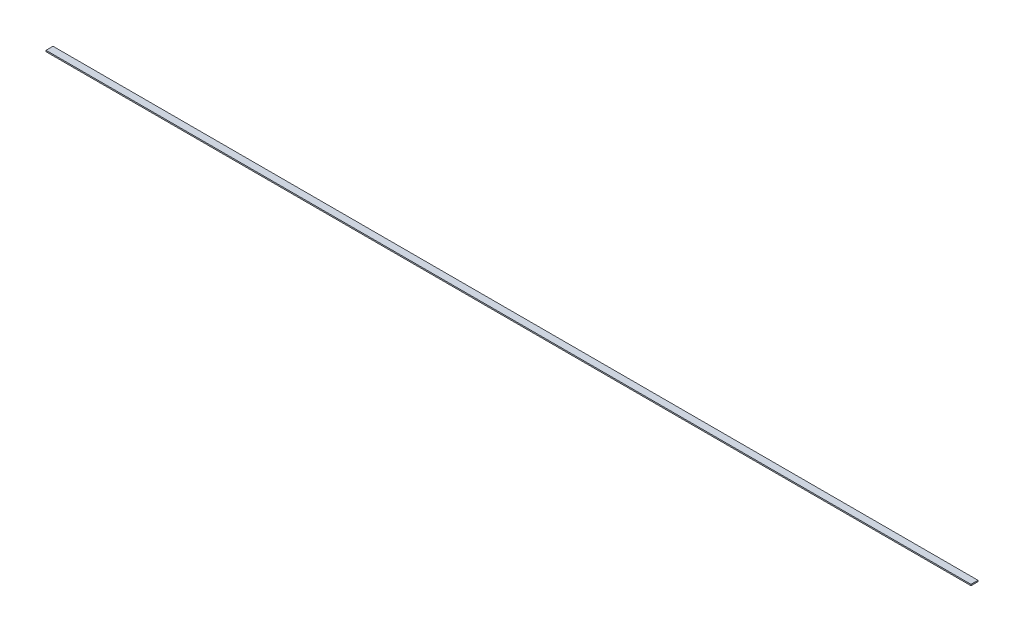
ISO-10303-21;
HEADER;
FILE_DESCRIPTION(('STEP AP214'),'2;1');
FILE_NAME('part.step','',(''),(''),'','','');
FILE_SCHEMA(('AUTOMOTIVE_DESIGN { 1 0 10303 214 1 1 1 1 }'));
ENDSEC;
DATA;
#1=APPLICATION_CONTEXT('core data for automotive mechanical design processes');
#2=APPLICATION_PROTOCOL_DEFINITION('international standard','automotive_design',2000,#1);
#3=PRODUCT_CONTEXT('',#1,'mechanical');
#4=PRODUCT('Part','Part','',(#3));
#5=PRODUCT_RELATED_PRODUCT_CATEGORY('part','',(#4));
#6=PRODUCT_DEFINITION_FORMATION('','',#4);
#7=PRODUCT_DEFINITION_CONTEXT('part definition',#1,'design');
#8=PRODUCT_DEFINITION('design','',#6,#7);
#9=PRODUCT_DEFINITION_SHAPE('','',#8);
#10=(LENGTH_UNIT() NAMED_UNIT(*) SI_UNIT(.MILLI.,.METRE.));
#11=(NAMED_UNIT(*) PLANE_ANGLE_UNIT() SI_UNIT($,.RADIAN.));
#12=(NAMED_UNIT(*) SI_UNIT($,.STERADIAN.) SOLID_ANGLE_UNIT());
#13=UNCERTAINTY_MEASURE_WITH_UNIT(LENGTH_MEASURE(1.E-05),#10,'distance_accuracy_value','');
#14=(GEOMETRIC_REPRESENTATION_CONTEXT(3) GLOBAL_UNCERTAINTY_ASSIGNED_CONTEXT((#13)) GLOBAL_UNIT_ASSIGNED_CONTEXT((#10,
#11,#12)) REPRESENTATION_CONTEXT('',''));
#15=CARTESIAN_POINT('',(0.,0.,0.));
#16=DIRECTION('',(0.,0.,1.));
#17=DIRECTION('',(1.,0.,0.));
#18=AXIS2_PLACEMENT_3D('',#15,#16,#17);
#19=CARTESIAN_POINT('',(393.,-0.545,0.));
#20=DIRECTION('',(-1.,0.,0.));
#21=DIRECTION('',(0.,0.,1.));
#22=AXIS2_PLACEMENT_3D('',#19,#20,#21);
#23=PLANE('',#22);
#24=DIRECTION('',(0.,-1.,0.));
#25=VECTOR('',#24,1.);
#26=CARTESIAN_POINT('',(393.,-0.545,6.));
#27=LINE('',#26,#25);
#28=CARTESIAN_POINT('',(393.,0.545,6.));
#29=VERTEX_POINT('',#28);
#30=CARTESIAN_POINT('',(393.,-0.545,6.));
#31=VERTEX_POINT('',#30);
#32=EDGE_CURVE('E20',#29,#31,#27,.T.);
#33=ORIENTED_EDGE('',*,*,#32,.T.);
#34=DIRECTION('',(0.,0.,1.));
#35=VECTOR('',#34,1.);
#36=CARTESIAN_POINT('',(393.,-0.545,0.));
#37=LINE('',#36,#35);
#38=CARTESIAN_POINT('',(393.,-0.545,0.));
#39=VERTEX_POINT('',#38);
#40=EDGE_CURVE('E115',#39,#31,#37,.T.);
#41=ORIENTED_EDGE('',*,*,#40,.F.);
#42=DIRECTION('',(0.,-1.,0.));
#43=VECTOR('',#42,1.);
#44=CARTESIAN_POINT('',(393.,-0.545,0.));
#45=LINE('',#44,#43);
#46=CARTESIAN_POINT('',(393.,0.545,0.));
#47=VERTEX_POINT('',#46);
#48=EDGE_CURVE('E10',#47,#39,#45,.T.);
#49=ORIENTED_EDGE('',*,*,#48,.F.);
#50=DIRECTION('',(0.,0.,1.));
#51=VECTOR('',#50,1.);
#52=CARTESIAN_POINT('',(393.,0.545,0.));
#53=LINE('',#52,#51);
#54=EDGE_CURVE('E80',#47,#29,#53,.T.);
#55=ORIENTED_EDGE('',*,*,#54,.T.);
#56=EDGE_LOOP('',(#33,#41,#49,#55));
#57=FACE_BOUND('',#56,.T.);
#58=ADVANCED_FACE('F17',(#57),#23,.F.);
#59=CARTESIAN_POINT('',(0.,0.,0.));
#60=DIRECTION('',(0.,0.,-1.));
#61=DIRECTION('',(0.,-1.,0.));
#62=AXIS2_PLACEMENT_3D('',#59,#60,#61);
#63=PLANE('',#62);
#64=ORIENTED_EDGE('',*,*,#48,.T.);
#65=DIRECTION('',(1.,0.,0.));
#66=VECTOR('',#65,1.);
#67=CARTESIAN_POINT('',(-400.,-0.545,0.));
#68=LINE('',#67,#66);
#69=CARTESIAN_POINT('',(-400.,-0.545,0.));
#70=VERTEX_POINT('',#69);
#71=EDGE_CURVE('E111',#70,#39,#68,.T.);
#72=ORIENTED_EDGE('',*,*,#71,.F.);
#73=DIRECTION('',(0.,-1.,0.));
#74=VECTOR('',#73,1.);
#75=CARTESIAN_POINT('',(-400.,-0.545,0.));
#76=LINE('',#75,#74);
#77=CARTESIAN_POINT('',(-400.,0.545,0.));
#78=VERTEX_POINT('',#77);
#79=EDGE_CURVE('E96',#78,#70,#76,.T.);
#80=ORIENTED_EDGE('',*,*,#79,.F.);
#81=DIRECTION('',(-1.,0.,0.));
#82=VECTOR('',#81,1.);
#83=CARTESIAN_POINT('',(-400.,0.545,0.));
#84=LINE('',#83,#82);
#85=EDGE_CURVE('E84',#47,#78,#84,.T.);
#86=ORIENTED_EDGE('',*,*,#85,.F.);
#87=EDGE_LOOP('',(#64,#72,#80,#86));
#88=FACE_BOUND('',#87,.T.);
#89=ADVANCED_FACE('F204',(#88),#63,.T.);
#90=CARTESIAN_POINT('',(0.,0.,6.));
#91=DIRECTION('',(0.,0.,-1.));
#92=DIRECTION('',(0.,-1.,0.));
#93=AXIS2_PLACEMENT_3D('',#90,#91,#92);
#94=PLANE('',#93);
#95=DIRECTION('',(1.,0.,0.));
#96=VECTOR('',#95,1.);
#97=CARTESIAN_POINT('',(-400.,-0.545,6.));
#98=LINE('',#97,#96);
#99=CARTESIAN_POINT('',(-400.,-0.545,6.));
#100=VERTEX_POINT('',#99);
#101=EDGE_CURVE('E76',#100,#31,#98,.T.);
#102=ORIENTED_EDGE('',*,*,#101,.T.);
#103=ORIENTED_EDGE('',*,*,#32,.F.);
#104=DIRECTION('',(-1.,0.,0.));
#105=VECTOR('',#104,1.);
#106=CARTESIAN_POINT('',(-400.,0.545,6.));
#107=LINE('',#106,#105);
#108=CARTESIAN_POINT('',(-400.,0.545,6.));
#109=VERTEX_POINT('',#108);
#110=EDGE_CURVE('E75',#29,#109,#107,.T.);
#111=ORIENTED_EDGE('',*,*,#110,.T.);
#112=DIRECTION('',(0.,-1.,0.));
#113=VECTOR('',#112,1.);
#114=CARTESIAN_POINT('',(-400.,-0.545,6.));
#115=LINE('',#114,#113);
#116=EDGE_CURVE('E108',#109,#100,#115,.T.);
#117=ORIENTED_EDGE('',*,*,#116,.T.);
#118=EDGE_LOOP('',(#102,#103,#111,#117));
#119=FACE_BOUND('',#118,.T.);
#120=ADVANCED_FACE('F72',(#119),#94,.F.);
#121=CARTESIAN_POINT('',(-400.,-0.545,6.));
#122=DIRECTION('',(0.,1.,0.));
#123=DIRECTION('',(1.,0.,0.));
#124=AXIS2_PLACEMENT_3D('',#121,#122,#123);
#125=PLANE('',#124);
#126=ORIENTED_EDGE('',*,*,#71,.T.);
#127=ORIENTED_EDGE('',*,*,#40,.T.);
#128=ORIENTED_EDGE('',*,*,#101,.F.);
#129=DIRECTION('',(0.,0.,-1.));
#130=VECTOR('',#129,1.);
#131=CARTESIAN_POINT('',(-400.,-0.545,6.));
#132=LINE('',#131,#130);
#133=EDGE_CURVE('E100',#100,#70,#132,.T.);
#134=ORIENTED_EDGE('',*,*,#133,.T.);
#135=EDGE_LOOP('',(#126,#127,#128,#134));
#136=FACE_BOUND('',#135,.T.);
#137=ADVANCED_FACE('F198',(#136),#125,.F.);
#138=CARTESIAN_POINT('',(-400.,-0.545,6.));
#139=DIRECTION('',(1.,0.,0.));
#140=DIRECTION('',(0.,1.,0.));
#141=AXIS2_PLACEMENT_3D('',#138,#139,#140);
#142=PLANE('',#141);
#143=ORIENTED_EDGE('',*,*,#79,.T.);
#144=ORIENTED_EDGE('',*,*,#133,.F.);
#145=ORIENTED_EDGE('',*,*,#116,.F.);
#146=DIRECTION('',(0.,0.,-1.));
#147=VECTOR('',#146,1.);
#148=CARTESIAN_POINT('',(-400.,0.545,6.));
#149=LINE('',#148,#147);
#150=EDGE_CURVE('E89',#109,#78,#149,.T.);
#151=ORIENTED_EDGE('',*,*,#150,.T.);
#152=EDGE_LOOP('',(#143,#144,#145,#151));
#153=FACE_BOUND('',#152,.T.);
#154=ADVANCED_FACE('F187',(#153),#142,.F.);
#155=CARTESIAN_POINT('',(-400.,0.545,6.));
#156=DIRECTION('',(0.,-1.,0.));
#157=DIRECTION('',(0.,0.,-1.));
#158=AXIS2_PLACEMENT_3D('',#155,#156,#157);
#159=PLANE('',#158);
#160=ORIENTED_EDGE('',*,*,#110,.F.);
#161=ORIENTED_EDGE('',*,*,#54,.F.);
#162=ORIENTED_EDGE('',*,*,#85,.T.);
#163=ORIENTED_EDGE('',*,*,#150,.F.);
#164=EDGE_LOOP('',(#160,#161,#162,#163));
#165=FACE_BOUND('',#164,.T.);
#166=ADVANCED_FACE('F87',(#165),#159,.F.);
#167=CLOSED_SHELL('',(#58,#89,#120,#137,#154,#166));
#168=MANIFOLD_SOLID_BREP('B1',#167);
#169=ADVANCED_BREP_SHAPE_REPRESENTATION('',(#18,#168),#14);
#170=SHAPE_DEFINITION_REPRESENTATION(#9,#169);
ENDSEC;
END-ISO-10303-21;
